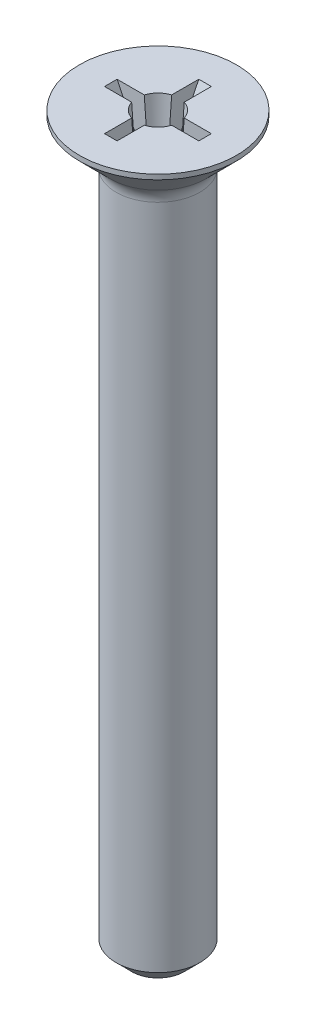
ISO-10303-21;
HEADER;
FILE_DESCRIPTION(('STEP AP214'),'2;1');
FILE_NAME('part.step','',(''),(''),'','','');
FILE_SCHEMA(('AUTOMOTIVE_DESIGN { 1 0 10303 214 1 1 1 1 }'));
ENDSEC;
DATA;
#1=APPLICATION_CONTEXT('core data for automotive mechanical design processes');
#2=APPLICATION_PROTOCOL_DEFINITION('international standard','automotive_design',2000,#1);
#3=PRODUCT_CONTEXT('',#1,'mechanical');
#4=PRODUCT('Part','Part','',(#3));
#5=PRODUCT_RELATED_PRODUCT_CATEGORY('part','',(#4));
#6=PRODUCT_DEFINITION_FORMATION('','',#4);
#7=PRODUCT_DEFINITION_CONTEXT('part definition',#1,'design');
#8=PRODUCT_DEFINITION('design','',#6,#7);
#9=PRODUCT_DEFINITION_SHAPE('','',#8);
#10=(LENGTH_UNIT() NAMED_UNIT(*) SI_UNIT(.MILLI.,.METRE.));
#11=(NAMED_UNIT(*) PLANE_ANGLE_UNIT() SI_UNIT($,.RADIAN.));
#12=(NAMED_UNIT(*) SI_UNIT($,.STERADIAN.) SOLID_ANGLE_UNIT());
#13=UNCERTAINTY_MEASURE_WITH_UNIT(LENGTH_MEASURE(1.E-05),#10,'distance_accuracy_value','');
#14=(GEOMETRIC_REPRESENTATION_CONTEXT(3) GLOBAL_UNCERTAINTY_ASSIGNED_CONTEXT((#13)) GLOBAL_UNIT_ASSIGNED_CONTEXT((#10,
#11,#12)) REPRESENTATION_CONTEXT('',''));
#15=CARTESIAN_POINT('',(0.,0.,0.));
#16=DIRECTION('',(0.,0.,1.));
#17=DIRECTION('',(1.,0.,0.));
#18=AXIS2_PLACEMENT_3D('',#15,#16,#17);
#19=CARTESIAN_POINT('',(0.,12.86,0.));
#20=DIRECTION('',(0.,1.,0.));
#21=DIRECTION('',(-1.,0.,0.));
#22=AXIS2_PLACEMENT_3D('',#19,#20,#21);
#23=CONICAL_SURFACE('',#22,0.320283434384406,0.0698131700797683);
#24=CARTESIAN_POINT('',(0.,14.,0.));
#25=DIRECTION('',(0.,1.,0.));
#26=DIRECTION('',(-1.,0.,0.));
#27=AXIS2_PLACEMENT_3D('',#24,#25,#26);
#28=CIRCLE('',#27,0.400000000000002);
#29=CARTESIAN_POINT('',(-0.381575680566779,14.,0.119999999999995));
#30=VERTEX_POINT('',#29);
#31=CARTESIAN_POINT('',(-0.12,14.,0.381575680566779));
#32=VERTEX_POINT('',#31);
#33=EDGE_CURVE('E260',#30,#32,#28,.T.);
#34=ORIENTED_EDGE('',*,*,#33,.T.);
#35=CARTESIAN_POINT('',(-0.12,15.1740824472663,0.466926394772055));
#36=CARTESIAN_POINT('',(-0.12,15.0242513219861,0.456108263948868));
#37=CARTESIAN_POINT('',(-0.12,14.8744218008497,0.445267913580182));
#38=CARTESIAN_POINT('',(-0.12,14.5747671449711,0.423529349100844));
#39=CARTESIAN_POINT('',(-0.12,14.4249420102236,0.41263113506235));
#40=CARTESIAN_POINT('',(-0.12,14.0593095650914,0.385947711733453));
#41=CARTESIAN_POINT('',(-0.12,13.8435050444475,0.370124175521628));
#42=CARTESIAN_POINT('',(-0.12,13.4119123652692,0.338257670637969));
#43=CARTESIAN_POINT('',(-0.12,13.1961242067238,0.322214702114726));
#44=CARTESIAN_POINT('',(-0.12,12.7645708959023,0.28980818309494));
#45=CARTESIAN_POINT('',(-0.12,12.5488057437202,0.273444631335357));
#46=CARTESIAN_POINT('',(-0.12,12.1173213669273,0.240116350239761));
#47=CARTESIAN_POINT('',(-0.12,11.9016021424536,0.223151619133535));
#48=CARTESIAN_POINT('',(-0.12,11.6859175527337,0.205746016838204));
#49=B_SPLINE_CURVE_WITH_KNOTS('',3,(#35,#36,#37,#38,#39,#40,#41,#42,#43,#44,#45,#46,#47,#48),
.UNSPECIFIED.,.F.,.F.,(4,2,2,2,2,2,4),(0.,0.450663487412317,0.901326412971773,1.55047789567899,
2.19962893883047,2.84878254003412,3.4979380528724),.UNSPECIFIED.);
#50=CARTESIAN_POINT('',(-0.12,12.86,0.296953663626282));
#51=VERTEX_POINT('',#50);
#52=EDGE_CURVE('E63',#32,#51,#49,.T.);
#53=ORIENTED_EDGE('',*,*,#52,.T.);
#54=CARTESIAN_POINT('',(0.,12.86,0.));
#55=DIRECTION('',(0.,1.,0.));
#56=DIRECTION('',(-1.,0.,0.));
#57=AXIS2_PLACEMENT_3D('',#54,#55,#56);
#58=CIRCLE('',#57,0.320283434384406);
#59=CARTESIAN_POINT('',(-0.29695366362628,12.86,0.119999999999995));
#60=VERTEX_POINT('',#59);
#61=EDGE_CURVE('E254',#60,#51,#58,.T.);
#62=ORIENTED_EDGE('',*,*,#61,.F.);
#63=CARTESIAN_POINT('',(-0.187820933769123,11.4671047713157,0.119999999999995));
#64=CARTESIAN_POINT('',(-0.193563556305856,11.5363168863722,0.119999999999995));
#65=CARTESIAN_POINT('',(-0.199232304699694,11.6055350727105,0.119999999999995));
#66=CARTESIAN_POINT('',(-0.210451948347549,11.7439808347204,0.119999999999995));
#67=CARTESIAN_POINT('',(-0.216002843889121,11.8132084103687,0.119999999999995));
#68=CARTESIAN_POINT('',(-0.243537554748596,12.1593644626035,0.119999999999995));
#69=CARTESIAN_POINT('',(-0.26486188936761,12.4363452438551,0.119999999999995));
#70=CARTESIAN_POINT('',(-0.30686468066746,12.9903567448575,0.119999999999995));
#71=CARTESIAN_POINT('',(-0.327543133428215,13.2673874649011,0.119999999999995));
#72=CARTESIAN_POINT('',(-0.370824552171335,13.8524858314913,0.119999999999995));
#73=CARTESIAN_POINT('',(-0.393383862392655,14.1605567086201,0.119999999999995));
#74=CARTESIAN_POINT('',(-0.438217174694349,14.776715510338,0.119999999999995));
#75=CARTESIAN_POINT('',(-0.460491180215733,15.0848034346764,0.119999999999995));
#76=CARTESIAN_POINT('',(-0.482708482373811,15.3928952286843,0.119999999999995));
#77=B_SPLINE_CURVE_WITH_KNOTS('',3,(#63,#64,#65,#66,#67,#68,#69,#70,#71,#72,#73,#74,#75,#76),
.UNSPECIFIED.,.F.,.F.,(4,2,2,2,2,2,4),(0.,0.208349707159258,0.416698905896739,1.25009792546417,
2.08350200223777,3.01018904395484,3.93686489851926),.UNSPECIFIED.);
#78=EDGE_CURVE('E301',#60,#30,#77,.T.);
#79=ORIENTED_EDGE('',*,*,#78,.T.);
#80=EDGE_LOOP('',(#34,#53,#62,#79));
#81=FACE_BOUND('',#80,.T.);
#82=ADVANCED_FACE('F42',(#81),#23,.F.);
#83=CARTESIAN_POINT('',(-0.12,12.86,-0.296953663626282));
#84=VERTEX_POINT('',#83);
#85=CARTESIAN_POINT('',(-0.29695366362628,12.86,-0.119999999999995));
#86=VERTEX_POINT('',#85);
#87=EDGE_CURVE('E264',#84,#86,#58,.T.);
#88=ORIENTED_EDGE('',*,*,#87,.F.);
#89=CARTESIAN_POINT('',(-0.12,11.6859175527337,-0.205746016838204));
#90=CARTESIAN_POINT('',(-0.12,11.7598931791331,-0.211733974991752));
#91=CARTESIAN_POINT('',(-0.12,11.8338739796323,-0.217657512604216));
#92=CARTESIAN_POINT('',(-0.12,11.9818436884213,-0.229401021808973));
#93=CARTESIAN_POINT('',(-0.12,12.055832596698,-0.235220993564825));
#94=CARTESIAN_POINT('',(-0.12,12.4257930473003,-0.264125223130743));
#95=CARTESIAN_POINT('',(-0.12,12.7218103478899,-0.286622436641393));
#96=CARTESIAN_POINT('',(-0.12,13.313889454487,-0.331030713125619));
#97=CARTESIAN_POINT('',(-0.12,13.609951260652,-0.352941773974435));
#98=CARTESIAN_POINT('',(-0.12,14.1173585648962,-0.39019870926174));
#99=CARTESIAN_POINT('',(-0.12,14.3286978823909,-0.405628694205982));
#100=CARTESIAN_POINT('',(-0.12,14.7513846677972,-0.436361242699685));
#101=CARTESIAN_POINT('',(-0.12,14.9627321356601,-0.451663806919752));
#102=CARTESIAN_POINT('',(-0.12,15.1740824472663,-0.466926394772055));
#103=B_SPLINE_CURVE_WITH_KNOTS('',3,(#89,#90,#91,#92,#93,#94,#95,#96,#97,#98,#99,#100,#101,
#102),.UNSPECIFIED.,.F.,.F.,(4,2,2,2,2,2,4),(0.,0.222652649737815,0.445304947812353,
1.33591611572056,2.22653051159222,2.86223598658223,3.49793811378913),.UNSPECIFIED.);
#104=CARTESIAN_POINT('',(-0.12,14.,-0.381575680566779));
#105=VERTEX_POINT('',#104);
#106=EDGE_CURVE('E56',#84,#105,#103,.T.);
#107=ORIENTED_EDGE('',*,*,#106,.T.);
#108=CARTESIAN_POINT('',(-0.381575680566779,14.,-0.119999999999995));
#109=VERTEX_POINT('',#108);
#110=EDGE_CURVE('E271',#105,#109,#28,.T.);
#111=ORIENTED_EDGE('',*,*,#110,.T.);
#112=CARTESIAN_POINT('',(-0.187820933769123,11.4671047713157,-0.119999999999995));
#113=CARTESIAN_POINT('',(-0.193563556305856,11.5363168863722,-0.119999999999995));
#114=CARTESIAN_POINT('',(-0.199232304699694,11.6055350727105,-0.119999999999995));
#115=CARTESIAN_POINT('',(-0.210451948347549,11.7439808347204,-0.119999999999995));
#116=CARTESIAN_POINT('',(-0.216002843889121,11.8132084103687,-0.119999999999995));
#117=CARTESIAN_POINT('',(-0.243537554748596,12.1593644626035,-0.119999999999995));
#118=CARTESIAN_POINT('',(-0.26486188936761,12.4363452438551,-0.119999999999995));
#119=CARTESIAN_POINT('',(-0.30686468066746,12.9903567448575,-0.119999999999995));
#120=CARTESIAN_POINT('',(-0.327543133428215,13.2673874649011,-0.119999999999995));
#121=CARTESIAN_POINT('',(-0.370824552171335,13.8524858314913,-0.119999999999995));
#122=CARTESIAN_POINT('',(-0.393383862392656,14.1605567086201,-0.119999999999995));
#123=CARTESIAN_POINT('',(-0.438217174694352,14.776715510338,-0.119999999999995));
#124=CARTESIAN_POINT('',(-0.460491180215736,15.0848034346765,-0.119999999999995));
#125=CARTESIAN_POINT('',(-0.482708482373815,15.3928952286844,-0.119999999999995));
#126=B_SPLINE_CURVE_WITH_KNOTS('',3,(#112,#113,#114,#115,#116,#117,#118,#119,#120,#121,#122,
#123,#124,#125),.UNSPECIFIED.,.F.,.F.,(4,2,2,2,2,2,4),(0.,0.208349707159258,0.416698905896739,
1.25009792546417,2.08350200223777,3.01018904395486,3.93686489851931),.UNSPECIFIED.);
#127=EDGE_CURVE('E394',#86,#109,#126,.T.);
#128=ORIENTED_EDGE('',*,*,#127,.F.);
#129=EDGE_LOOP('',(#88,#107,#111,#128));
#130=FACE_BOUND('',#129,.T.);
#131=ADVANCED_FACE('F357',(#130),#23,.F.);
#132=CARTESIAN_POINT('',(0.12,15.1740824472663,0.466926394772055));
#133=CARTESIAN_POINT('',(0.12,15.0242513219861,0.456108263948871));
#134=CARTESIAN_POINT('',(0.12,14.8744218008497,0.445267913580184));
#135=CARTESIAN_POINT('',(0.12,14.5747671449711,0.423529349100846));
#136=CARTESIAN_POINT('',(0.12,14.4249420102236,0.41263113506235));
#137=CARTESIAN_POINT('',(0.12,14.0593095650914,0.385947711733453));
#138=CARTESIAN_POINT('',(0.12,13.8435050444475,0.370124175521629));
#139=CARTESIAN_POINT('',(0.12,13.4119123652692,0.338257670637971));
#140=CARTESIAN_POINT('',(0.12,13.1961242067238,0.322214702114727));
#141=CARTESIAN_POINT('',(0.12,12.7645708959023,0.28980818309494));
#142=CARTESIAN_POINT('',(0.12,12.5488057437202,0.273444631335356));
#143=CARTESIAN_POINT('',(0.12,12.1173213669273,0.24011635023976));
#144=CARTESIAN_POINT('',(0.12,11.9016021424536,0.223151619133534));
#145=CARTESIAN_POINT('',(0.12,11.6859175527337,0.205746016838204));
#146=B_SPLINE_CURVE_WITH_KNOTS('',3,(#132,#133,#134,#135,#136,#137,#138,#139,#140,#141,#142,
#143,#144,#145),.UNSPECIFIED.,.F.,.F.,(4,2,2,2,2,2,4),(0.,0.450663487412317,0.901326412971773,
1.55047789567899,2.19962893883047,2.84878254003412,3.4979380528724),.UNSPECIFIED.);
#147=CARTESIAN_POINT('',(0.12,14.,0.381575680566779));
#148=VERTEX_POINT('',#147);
#149=CARTESIAN_POINT('',(0.12,12.86,0.296953663626282));
#150=VERTEX_POINT('',#149);
#151=EDGE_CURVE('E224',#148,#150,#146,.T.);
#152=ORIENTED_EDGE('',*,*,#151,.F.);
#153=CARTESIAN_POINT('',(0.381575680566782,14.,0.119999999999995));
#154=VERTEX_POINT('',#153);
#155=EDGE_CURVE('E265',#148,#154,#28,.T.);
#156=ORIENTED_EDGE('',*,*,#155,.T.);
#157=CARTESIAN_POINT('',(0.482708482373816,15.3928952286843,0.119999999999995));
#158=CARTESIAN_POINT('',(0.471569124413629,15.2383071523705,0.119999999999995));
#159=CARTESIAN_POINT('',(0.460408440154064,15.0837206120034,0.119999999999995));
#160=CARTESIAN_POINT('',(0.438031378451938,14.7745517948923,0.119999999999995));
#161=CARTESIAN_POINT('',(0.426815001092503,14.6199695181423,0.119999999999995));
#162=CARTESIAN_POINT('',(0.397374651708443,14.2154739650048,0.119999999999995));
#163=CARTESIAN_POINT('',(0.37909518965734,13.9655647184375,0.119999999999995));
#164=CARTESIAN_POINT('',(0.342262541830037,13.4657666524732,0.119999999999995));
#165=CARTESIAN_POINT('',(0.323709356352955,13.2158778330542,0.119999999999995));
#166=CARTESIAN_POINT('',(0.286158435803668,12.7161319689566,0.119999999999995));
#167=CARTESIAN_POINT('',(0.267160698237998,12.4662749244641,0.119999999999995));
#168=CARTESIAN_POINT('',(0.238044995888112,12.0915366773594,0.119999999999995));
#169=CARTESIAN_POINT('',(0.228236556284122,11.9666315332682,0.119999999999995));
#170=CARTESIAN_POINT('',(0.208298411255087,11.716846612886,0.119999999999995));
#171=CARTESIAN_POINT('',(0.198168704997794,11.5919668366615,0.119999999999995));
#172=CARTESIAN_POINT('',(0.187820933769118,11.4671047713157,0.119999999999995));
#173=B_SPLINE_CURVE_WITH_KNOTS('',3,(#157,#158,#159,#160,#161,#162,#163,#164,#165,#166,#167,
#168,#169,#170,#171,#172),.UNSPECIFIED.,.F.,.F.,(4,2,2,2,2,2,2,4),(0.,0.464966692939739,
0.92993269209604,1.6816632061309,2.43339289875489,3.18512680879476,3.56099545931275,
3.93686508360733),.UNSPECIFIED.);
#174=CARTESIAN_POINT('',(0.29695366362628,12.86,0.119999999999995));
#175=VERTEX_POINT('',#174);
#176=EDGE_CURVE('E292',#154,#175,#173,.T.);
#177=ORIENTED_EDGE('',*,*,#176,.T.);
#178=EDGE_CURVE('E258',#150,#175,#58,.T.);
#179=ORIENTED_EDGE('',*,*,#178,.F.);
#180=EDGE_LOOP('',(#152,#156,#177,#179));
#181=FACE_BOUND('',#180,.T.);
#182=ADVANCED_FACE('F351',(#181),#23,.F.);
#183=CARTESIAN_POINT('',(-0.400000000000001,14.,0.));
#184=DIRECTION('',(0.,1.,0.));
#185=DIRECTION('',(-1.,0.,0.));
#186=AXIS2_PLACEMENT_3D('',#183,#184,#185);
#187=PLANE('',#186);
#188=DIRECTION('',(0.,0.,1.));
#189=VECTOR('',#188,1.);
#190=CARTESIAN_POINT('',(0.12,14.,0.899999999999998));
#191=LINE('',#190,#189);
#192=CARTESIAN_POINT('',(0.12,14.,0.899999999999998));
#193=VERTEX_POINT('',#192);
#194=EDGE_CURVE('E200',#148,#193,#191,.T.);
#195=ORIENTED_EDGE('',*,*,#194,.T.);
#196=DIRECTION('',(-1.,0.,0.));
#197=VECTOR('',#196,1.);
#198=CARTESIAN_POINT('',(0.12,14.,0.899999999999998));
#199=LINE('',#198,#197);
#200=CARTESIAN_POINT('',(-0.12,14.,0.899999999999998));
#201=VERTEX_POINT('',#200);
#202=EDGE_CURVE('E211',#193,#201,#199,.T.);
#203=ORIENTED_EDGE('',*,*,#202,.T.);
#204=DIRECTION('',(0.,0.,1.));
#205=VECTOR('',#204,1.);
#206=CARTESIAN_POINT('',(-0.12,14.,0.899999999999998));
#207=LINE('',#206,#205);
#208=EDGE_CURVE('E181',#32,#201,#207,.T.);
#209=ORIENTED_EDGE('',*,*,#208,.F.);
#210=ORIENTED_EDGE('',*,*,#33,.F.);
#211=DIRECTION('',(-1.,0.,0.));
#212=VECTOR('',#211,1.);
#213=CARTESIAN_POINT('',(-0.400000000000001,14.,0.119999999999995));
#214=LINE('',#213,#212);
#215=CARTESIAN_POINT('',(-0.900000000000001,14.,0.119999999999995));
#216=VERTEX_POINT('',#215);
#217=EDGE_CURVE('E247',#30,#216,#214,.T.);
#218=ORIENTED_EDGE('',*,*,#217,.T.);
#219=DIRECTION('',(0.,0.,-1.));
#220=VECTOR('',#219,1.);
#221=CARTESIAN_POINT('',(-0.900000000000001,14.,0.119999999999995));
#222=LINE('',#221,#220);
#223=CARTESIAN_POINT('',(-0.900000000000001,14.,-0.119999999999995));
#224=VERTEX_POINT('',#223);
#225=EDGE_CURVE('E404',#216,#224,#222,.T.);
#226=ORIENTED_EDGE('',*,*,#225,.T.);
#227=DIRECTION('',(-1.,0.,0.));
#228=VECTOR('',#227,1.);
#229=CARTESIAN_POINT('',(-0.400000000000001,14.,-0.119999999999995));
#230=LINE('',#229,#228);
#231=EDGE_CURVE('E251',#109,#224,#230,.T.);
#232=ORIENTED_EDGE('',*,*,#231,.F.);
#233=ORIENTED_EDGE('',*,*,#110,.F.);
#234=CARTESIAN_POINT('',(-0.12,14.,-0.899999999999998));
#235=VERTEX_POINT('',#234);
#236=EDGE_CURVE('E71',#235,#105,#207,.T.);
#237=ORIENTED_EDGE('',*,*,#236,.F.);
#238=DIRECTION('',(-1.,0.,0.));
#239=VECTOR('',#238,1.);
#240=CARTESIAN_POINT('',(0.12,14.,-0.899999999999998));
#241=LINE('',#240,#239);
#242=CARTESIAN_POINT('',(0.12,14.,-0.899999999999998));
#243=VERTEX_POINT('',#242);
#244=EDGE_CURVE('E176',#243,#235,#241,.T.);
#245=ORIENTED_EDGE('',*,*,#244,.F.);
#246=CARTESIAN_POINT('',(0.12,14.,-0.381575680566779));
#247=VERTEX_POINT('',#246);
#248=EDGE_CURVE('E201',#243,#247,#191,.T.);
#249=ORIENTED_EDGE('',*,*,#248,.T.);
#250=CARTESIAN_POINT('',(0.381575680566782,14.,-0.119999999999995));
#251=VERTEX_POINT('',#250);
#252=EDGE_CURVE('E266',#251,#247,#28,.T.);
#253=ORIENTED_EDGE('',*,*,#252,.F.);
#254=DIRECTION('',(-1.,0.,0.));
#255=VECTOR('',#254,1.);
#256=CARTESIAN_POINT('',(-0.900000000000001,14.,-0.119999999999995));
#257=LINE('',#256,#255);
#258=CARTESIAN_POINT('',(0.899999999999998,14.,-0.119999999999995));
#259=VERTEX_POINT('',#258);
#260=EDGE_CURVE('E448',#259,#251,#257,.T.);
#261=ORIENTED_EDGE('',*,*,#260,.F.);
#262=DIRECTION('',(0.,0.,-1.));
#263=VECTOR('',#262,1.);
#264=CARTESIAN_POINT('',(0.899999999999998,14.,0.119999999999995));
#265=LINE('',#264,#263);
#266=CARTESIAN_POINT('',(0.899999999999998,14.,0.119999999999995));
#267=VERTEX_POINT('',#266);
#268=EDGE_CURVE('E426',#267,#259,#265,.T.);
#269=ORIENTED_EDGE('',*,*,#268,.F.);
#270=DIRECTION('',(-1.,0.,0.));
#271=VECTOR('',#270,1.);
#272=CARTESIAN_POINT('',(-0.900000000000001,14.,0.119999999999995));
#273=LINE('',#272,#271);
#274=EDGE_CURVE('E441',#267,#154,#273,.T.);
#275=ORIENTED_EDGE('',*,*,#274,.T.);
#276=ORIENTED_EDGE('',*,*,#155,.F.);
#277=EDGE_LOOP('',(#195,#203,#209,#210,#218,#226,#232,#233,#237,#245,#249,#253,#261,#269,#275,#276));
#278=FACE_BOUND('',#277,.T.);
#279=CARTESIAN_POINT('',(0.,14.,0.));
#280=DIRECTION('',(0.,1.,0.));
#281=DIRECTION('',(-1.,0.,0.));
#282=AXIS2_PLACEMENT_3D('',#279,#280,#281);
#283=CIRCLE('',#282,1.5);
#284=CARTESIAN_POINT('',(-1.5,14.,0.));
#285=VERTEX_POINT('',#284);
#286=EDGE_CURVE('E267',#285,#285,#283,.T.);
#287=ORIENTED_EDGE('',*,*,#286,.T.);
#288=EDGE_LOOP('',(#287));
#289=FACE_BOUND('',#288,.T.);
#290=ADVANCED_FACE('F349',(#278,#289),#187,.T.);
#291=CARTESIAN_POINT('',(-0.320283434384406,12.86,0.));
#292=DIRECTION('',(0.,1.,0.));
#293=DIRECTION('',(-1.,0.,0.));
#294=AXIS2_PLACEMENT_3D('',#291,#292,#293);
#295=PLANE('',#294);
#296=CARTESIAN_POINT('',(0.29695366362628,12.86,-0.119999999999995));
#297=VERTEX_POINT('',#296);
#298=CARTESIAN_POINT('',(0.12,12.86,-0.296953663626282));
#299=VERTEX_POINT('',#298);
#300=EDGE_CURVE('E259',#297,#299,#58,.T.);
#301=ORIENTED_EDGE('',*,*,#300,.T.);
#302=DIRECTION('',(0.,0.,-1.));
#303=VECTOR('',#302,1.);
#304=CARTESIAN_POINT('',(0.12,12.86,0.343984849034917));
#305=LINE('',#304,#303);
#306=CARTESIAN_POINT('',(0.12,12.86,-0.343984849034917));
#307=VERTEX_POINT('',#306);
#308=EDGE_CURVE('E172',#299,#307,#305,.T.);
#309=ORIENTED_EDGE('',*,*,#308,.T.);
#310=DIRECTION('',(-1.,0.,0.));
#311=VECTOR('',#310,1.);
#312=CARTESIAN_POINT('',(0.12,12.86,-0.343984849034917));
#313=LINE('',#312,#311);
#314=CARTESIAN_POINT('',(-0.12,12.86,-0.343984849034917));
#315=VERTEX_POINT('',#314);
#316=EDGE_CURVE('E170',#307,#315,#313,.T.);
#317=ORIENTED_EDGE('',*,*,#316,.T.);
#318=DIRECTION('',(0.,0.,-1.));
#319=VECTOR('',#318,1.);
#320=CARTESIAN_POINT('',(-0.12,12.86,0.343984849034917));
#321=LINE('',#320,#319);
#322=EDGE_CURVE('E159',#84,#315,#321,.T.);
#323=ORIENTED_EDGE('',*,*,#322,.F.);
#324=ORIENTED_EDGE('',*,*,#87,.T.);
#325=DIRECTION('',(1.,0.,0.));
#326=VECTOR('',#325,1.);
#327=CARTESIAN_POINT('',(-0.343984849034917,12.86,-0.119999999999995));
#328=LINE('',#327,#326);
#329=CARTESIAN_POINT('',(-0.343984849034917,12.86,-0.119999999999995));
#330=VERTEX_POINT('',#329);
#331=EDGE_CURVE('E389',#330,#86,#328,.T.);
#332=ORIENTED_EDGE('',*,*,#331,.F.);
#333=DIRECTION('',(0.,0.,-1.));
#334=VECTOR('',#333,1.);
#335=CARTESIAN_POINT('',(-0.343984849034917,12.86,0.119999999999995));
#336=LINE('',#335,#334);
#337=CARTESIAN_POINT('',(-0.343984849034917,12.86,0.119999999999995));
#338=VERTEX_POINT('',#337);
#339=EDGE_CURVE('E410',#338,#330,#336,.T.);
#340=ORIENTED_EDGE('',*,*,#339,.F.);
#341=DIRECTION('',(1.,0.,0.));
#342=VECTOR('',#341,1.);
#343=CARTESIAN_POINT('',(-0.343984849034917,12.86,0.119999999999995));
#344=LINE('',#343,#342);
#345=EDGE_CURVE('E433',#338,#60,#344,.T.);
#346=ORIENTED_EDGE('',*,*,#345,.T.);
#347=ORIENTED_EDGE('',*,*,#61,.T.);
#348=CARTESIAN_POINT('',(-0.12,12.86,0.343984849034917));
#349=VERTEX_POINT('',#348);
#350=EDGE_CURVE('E167',#349,#51,#321,.T.);
#351=ORIENTED_EDGE('',*,*,#350,.F.);
#352=DIRECTION('',(-1.,0.,0.));
#353=VECTOR('',#352,1.);
#354=CARTESIAN_POINT('',(0.12,12.86,0.343984849034917));
#355=LINE('',#354,#353);
#356=CARTESIAN_POINT('',(0.12,12.86,0.343984849034917));
#357=VERTEX_POINT('',#356);
#358=EDGE_CURVE('E208',#357,#349,#355,.T.);
#359=ORIENTED_EDGE('',*,*,#358,.F.);
#360=EDGE_CURVE('E193',#357,#150,#305,.T.);
#361=ORIENTED_EDGE('',*,*,#360,.T.);
#362=ORIENTED_EDGE('',*,*,#178,.T.);
#363=CARTESIAN_POINT('',(0.343984849034914,12.86,0.119999999999995));
#364=VERTEX_POINT('',#363);
#365=EDGE_CURVE('E437',#175,#364,#344,.T.);
#366=ORIENTED_EDGE('',*,*,#365,.T.);
#367=DIRECTION('',(0.,0.,-1.));
#368=VECTOR('',#367,1.);
#369=CARTESIAN_POINT('',(0.343984849034914,12.86,0.119999999999995));
#370=LINE('',#369,#368);
#371=CARTESIAN_POINT('',(0.343984849034914,12.86,-0.119999999999995));
#372=VERTEX_POINT('',#371);
#373=EDGE_CURVE('E423',#364,#372,#370,.T.);
#374=ORIENTED_EDGE('',*,*,#373,.T.);
#375=EDGE_CURVE('E380',#297,#372,#328,.T.);
#376=ORIENTED_EDGE('',*,*,#375,.F.);
#377=EDGE_LOOP('',(#301,#309,#317,#323,#324,#332,#340,#346,#347,#351,#359,#361,#362,#366,#374,#376));
#378=FACE_BOUND('',#377,.T.);
#379=ADVANCED_FACE('F44',(#378),#295,.T.);
#380=CARTESIAN_POINT('',(0.12,11.6859175527337,-0.205746016838204));
#381=CARTESIAN_POINT('',(0.12,11.7598931791331,-0.211733974991751));
#382=CARTESIAN_POINT('',(0.12,11.8338739796323,-0.217657512604214));
#383=CARTESIAN_POINT('',(0.12,11.9818436884213,-0.229401021808971));
#384=CARTESIAN_POINT('',(0.12,12.055832596698,-0.235220993564824));
#385=CARTESIAN_POINT('',(0.12,12.4257930473003,-0.264125223130746));
#386=CARTESIAN_POINT('',(0.12,12.7218103478899,-0.286622436641394));
#387=CARTESIAN_POINT('',(0.12,13.313889454487,-0.331030713125619));
#388=CARTESIAN_POINT('',(0.12,13.609951260652,-0.352941773974435));
#389=CARTESIAN_POINT('',(0.12,14.1173585648962,-0.390198709261741));
#390=CARTESIAN_POINT('',(0.12,14.3286978823909,-0.405628694205983));
#391=CARTESIAN_POINT('',(0.12,14.7513846677972,-0.436361242699687));
#392=CARTESIAN_POINT('',(0.12,14.9627321356601,-0.451663806919754));
#393=CARTESIAN_POINT('',(0.12,15.1740824472663,-0.466926394772055));
#394=B_SPLINE_CURVE_WITH_KNOTS('',3,(#380,#381,#382,#383,#384,#385,#386,#387,#388,#389,#390,
#391,#392,#393),.UNSPECIFIED.,.F.,.F.,(4,2,2,2,2,2,4),(0.,0.222652649737815,0.445304947812353,
1.33591611572056,2.22653051159222,2.86223598658222,3.49793811378913),.UNSPECIFIED.);
#395=EDGE_CURVE('E11',#299,#247,#394,.T.);
#396=ORIENTED_EDGE('',*,*,#395,.F.);
#397=ORIENTED_EDGE('',*,*,#300,.F.);
#398=CARTESIAN_POINT('',(0.482708482373816,15.3928952286843,-0.119999999999995));
#399=CARTESIAN_POINT('',(0.471569124413629,15.2383071523705,-0.119999999999995));
#400=CARTESIAN_POINT('',(0.460408440154064,15.0837206120034,-0.119999999999995));
#401=CARTESIAN_POINT('',(0.438031378451938,14.7745517948923,-0.119999999999995));
#402=CARTESIAN_POINT('',(0.426815001092503,14.6199695181423,-0.119999999999995));
#403=CARTESIAN_POINT('',(0.397374651708443,14.2154739650048,-0.119999999999995));
#404=CARTESIAN_POINT('',(0.37909518965734,13.9655647184375,-0.119999999999995));
#405=CARTESIAN_POINT('',(0.342262541830037,13.4657666524732,-0.119999999999995));
#406=CARTESIAN_POINT('',(0.323709356352955,13.2158778330542,-0.119999999999995));
#407=CARTESIAN_POINT('',(0.286158435803668,12.7161319689566,-0.119999999999995));
#408=CARTESIAN_POINT('',(0.267160698237998,12.4662749244641,-0.119999999999995));
#409=CARTESIAN_POINT('',(0.238044995888112,12.0915366773594,-0.119999999999995));
#410=CARTESIAN_POINT('',(0.228236556284122,11.9666315332682,-0.119999999999995));
#411=CARTESIAN_POINT('',(0.208298411255087,11.716846612886,-0.119999999999995));
#412=CARTESIAN_POINT('',(0.198168704997794,11.5919668366615,-0.119999999999995));
#413=CARTESIAN_POINT('',(0.187820933769118,11.4671047713157,-0.119999999999995));
#414=B_SPLINE_CURVE_WITH_KNOTS('',3,(#398,#399,#400,#401,#402,#403,#404,#405,#406,#407,#408,
#409,#410,#411,#412,#413),.UNSPECIFIED.,.F.,.F.,(4,2,2,2,2,2,2,4),(0.,0.464966692939739,
0.92993269209604,1.6816632061309,2.43339289875489,3.18512680879476,3.56099545931275,
3.93686508360733),.UNSPECIFIED.);
#415=EDGE_CURVE('E403',#251,#297,#414,.T.);
#416=ORIENTED_EDGE('',*,*,#415,.F.);
#417=ORIENTED_EDGE('',*,*,#252,.T.);
#418=EDGE_LOOP('',(#396,#397,#416,#417));
#419=FACE_BOUND('',#418,.T.);
#420=ADVANCED_FACE('F230',(#419),#23,.F.);
#421=CARTESIAN_POINT('',(0.,12.86,0.));
#422=DIRECTION('',(0.,1.,0.));
#423=DIRECTION('',(-1.,0.,0.));
#424=AXIS2_PLACEMENT_3D('',#421,#422,#423);
#425=CYLINDRICAL_SURFACE('',#424,1.5);
#426=CARTESIAN_POINT('',(0.,13.9056854249492,0.));
#427=DIRECTION('',(0.,1.,0.));
#428=DIRECTION('',(-1.,0.,0.));
#429=AXIS2_PLACEMENT_3D('',#426,#427,#428);
#430=CIRCLE('',#429,1.5);
#431=CARTESIAN_POINT('',(-1.5,13.9056854249492,0.));
#432=VERTEX_POINT('',#431);
#433=EDGE_CURVE('E272',#432,#432,#430,.T.);
#434=ORIENTED_EDGE('',*,*,#433,.T.);
#435=EDGE_LOOP('',(#434));
#436=FACE_BOUND('',#435,.T.);
#437=ORIENTED_EDGE('',*,*,#286,.F.);
#438=EDGE_LOOP('',(#437));
#439=FACE_BOUND('',#438,.T.);
#440=ADVANCED_FACE('F345',(#436,#439),#425,.T.);
#441=CARTESIAN_POINT('',(0.,13.9056854249492,0.));
#442=DIRECTION('',(0.,1.,0.));
#443=DIRECTION('',(-1.,0.,0.));
#444=AXIS2_PLACEMENT_3D('',#441,#442,#443);
#445=CONICAL_SURFACE('',#444,1.5,0.785398163397446);
#446=CARTESIAN_POINT('',(0.,13.3228427124746,0.));
#447=DIRECTION('',(0.,1.,0.));
#448=DIRECTION('',(-1.,0.,0.));
#449=AXIS2_PLACEMENT_3D('',#446,#447,#448);
#450=CIRCLE('',#449,0.91715728752538);
#451=CARTESIAN_POINT('',(-0.91715728752538,13.3228427124746,0.));
#452=VERTEX_POINT('',#451);
#453=EDGE_CURVE('E276',#452,#452,#450,.T.);
#454=ORIENTED_EDGE('',*,*,#453,.T.);
#455=EDGE_LOOP('',(#454));
#456=FACE_BOUND('',#455,.T.);
#457=ORIENTED_EDGE('',*,*,#433,.F.);
#458=EDGE_LOOP('',(#457));
#459=FACE_BOUND('',#458,.T.);
#460=ADVANCED_FACE('F341',(#456,#459),#445,.T.);
#461=CARTESIAN_POINT('',(0.,13.04,0.));
#462=DIRECTION('',(0.,1.,0.));
#463=DIRECTION('',(-1.,0.,0.));
#464=AXIS2_PLACEMENT_3D('',#461,#462,#463);
#465=TOROIDAL_SURFACE('',#464,1.2,0.4);
#466=CARTESIAN_POINT('',(0.,13.04,0.));
#467=DIRECTION('',(0.,1.,0.));
#468=DIRECTION('',(-1.,0.,0.));
#469=AXIS2_PLACEMENT_3D('',#466,#467,#468);
#470=CIRCLE('',#469,0.8);
#471=CARTESIAN_POINT('',(-0.8,13.04,0.));
#472=VERTEX_POINT('',#471);
#473=EDGE_CURVE('E280',#472,#472,#470,.T.);
#474=ORIENTED_EDGE('',*,*,#473,.T.);
#475=EDGE_LOOP('',(#474));
#476=FACE_BOUND('',#475,.T.);
#477=ORIENTED_EDGE('',*,*,#453,.F.);
#478=EDGE_LOOP('',(#477));
#479=FACE_BOUND('',#478,.T.);
#480=ADVANCED_FACE('F337',(#476,#479),#465,.F.);
#481=CARTESIAN_POINT('',(0.,12.86,0.));
#482=DIRECTION('',(0.,1.,0.));
#483=DIRECTION('',(-1.,0.,0.));
#484=AXIS2_PLACEMENT_3D('',#481,#482,#483);
#485=CYLINDRICAL_SURFACE('',#484,0.799999999999988);
#486=CARTESIAN_POINT('',(0.,0.299999999999998,0.));
#487=DIRECTION('',(0.,1.,0.));
#488=DIRECTION('',(-1.,0.,0.));
#489=AXIS2_PLACEMENT_3D('',#486,#487,#488);
#490=CIRCLE('',#489,0.799999999999977);
#491=CARTESIAN_POINT('',(-0.799999999999999,0.3,0.));
#492=VERTEX_POINT('',#491);
#493=EDGE_CURVE('E284',#492,#492,#490,.T.);
#494=ORIENTED_EDGE('',*,*,#493,.T.);
#495=EDGE_LOOP('',(#494));
#496=FACE_BOUND('',#495,.T.);
#497=ORIENTED_EDGE('',*,*,#473,.F.);
#498=EDGE_LOOP('',(#497));
#499=FACE_BOUND('',#498,.T.);
#500=ADVANCED_FACE('F333',(#496,#499),#485,.T.);
#501=CARTESIAN_POINT('',(0.,0.299999999999998,0.));
#502=DIRECTION('',(0.,1.,0.));
#503=DIRECTION('',(-1.,0.,0.));
#504=AXIS2_PLACEMENT_3D('',#501,#502,#503);
#505=CONICAL_SURFACE('',#504,0.799999999999977,0.785398163397444);
#506=CARTESIAN_POINT('',(0.,0.,0.));
#507=DIRECTION('',(0.,1.,0.));
#508=DIRECTION('',(-1.,0.,0.));
#509=AXIS2_PLACEMENT_3D('',#506,#507,#508);
#510=CIRCLE('',#509,0.499999999999979);
#511=CARTESIAN_POINT('',(-0.500000000000004,0.,0.));
#512=VERTEX_POINT('',#511);
#513=EDGE_CURVE('E288',#512,#512,#510,.T.);
#514=ORIENTED_EDGE('',*,*,#513,.T.);
#515=EDGE_LOOP('',(#514));
#516=FACE_BOUND('',#515,.T.);
#517=ORIENTED_EDGE('',*,*,#493,.F.);
#518=EDGE_LOOP('',(#517));
#519=FACE_BOUND('',#518,.T.);
#520=ADVANCED_FACE('F329',(#516,#519),#505,.T.);
#521=CARTESIAN_POINT('',(0.,0.,0.));
#522=DIRECTION('',(0.,-1.,0.));
#523=DIRECTION('',(1.,0.,0.));
#524=AXIS2_PLACEMENT_3D('',#521,#522,#523);
#525=PLANE('',#524);
#526=ORIENTED_EDGE('',*,*,#513,.F.);
#527=EDGE_LOOP('',(#526));
#528=FACE_BOUND('',#527,.T.);
#529=ADVANCED_FACE('F313',(#528),#525,.T.);
#530=CARTESIAN_POINT('',(0.,0.,0.119999999999995));
#531=DIRECTION('',(0.,0.,-1.));
#532=DIRECTION('',(-1.,0.,0.));
#533=AXIS2_PLACEMENT_3D('',#530,#531,#532);
#534=PLANE('',#533);
#535=ORIENTED_EDGE('',*,*,#345,.F.);
#536=DIRECTION('',(0.438371146789079,-0.898794046299166,0.));
#537=VECTOR('',#536,1.);
#538=CARTESIAN_POINT('',(-0.900000000000001,14.,0.119999999999995));
#539=LINE('',#538,#537);
#540=EDGE_CURVE('E438',#216,#338,#539,.T.);
#541=ORIENTED_EDGE('',*,*,#540,.F.);
#542=ORIENTED_EDGE('',*,*,#217,.F.);
#543=ORIENTED_EDGE('',*,*,#78,.F.);
#544=EDGE_LOOP('',(#535,#541,#542,#543));
#545=FACE_BOUND('',#544,.T.);
#546=ADVANCED_FACE('F307',(#545),#534,.T.);
#547=CARTESIAN_POINT('',(0.,0.,-0.119999999999995));
#548=DIRECTION('',(0.,0.,-1.));
#549=DIRECTION('',(-1.,0.,0.));
#550=AXIS2_PLACEMENT_3D('',#547,#548,#549);
#551=PLANE('',#550);
#552=ORIENTED_EDGE('',*,*,#127,.T.);
#553=ORIENTED_EDGE('',*,*,#231,.T.);
#554=DIRECTION('',(0.438371146789079,-0.898794046299166,0.));
#555=VECTOR('',#554,1.);
#556=CARTESIAN_POINT('',(-0.900000000000001,14.,-0.119999999999995));
#557=LINE('',#556,#555);
#558=EDGE_CURVE('E397',#224,#330,#557,.T.);
#559=ORIENTED_EDGE('',*,*,#558,.T.);
#560=ORIENTED_EDGE('',*,*,#331,.T.);
#561=EDGE_LOOP('',(#552,#553,#559,#560));
#562=FACE_BOUND('',#561,.T.);
#563=ADVANCED_FACE('F312',(#562),#551,.F.);
#564=CARTESIAN_POINT('',(-0.900000000000001,14.,0.119999999999995));
#565=DIRECTION('',(0.898794046299166,0.438371146789079,0.));
#566=DIRECTION('',(-0.438371146789079,0.898794046299166,0.));
#567=AXIS2_PLACEMENT_3D('',#564,#565,#566);
#568=PLANE('',#567);
#569=ORIENTED_EDGE('',*,*,#225,.F.);
#570=ORIENTED_EDGE('',*,*,#540,.T.);
#571=ORIENTED_EDGE('',*,*,#339,.T.);
#572=ORIENTED_EDGE('',*,*,#558,.F.);
#573=EDGE_LOOP('',(#569,#570,#571,#572));
#574=FACE_BOUND('',#573,.T.);
#575=ADVANCED_FACE('F323',(#574),#568,.T.);
#576=ORIENTED_EDGE('',*,*,#274,.F.);
#577=DIRECTION('',(0.438371146789079,0.898794046299167,0.));
#578=VECTOR('',#577,1.);
#579=CARTESIAN_POINT('',(0.899999999999998,14.,0.119999999999995));
#580=LINE('',#579,#578);
#581=EDGE_CURVE('E430',#364,#267,#580,.T.);
#582=ORIENTED_EDGE('',*,*,#581,.F.);
#583=ORIENTED_EDGE('',*,*,#365,.F.);
#584=ORIENTED_EDGE('',*,*,#176,.F.);
#585=EDGE_LOOP('',(#576,#582,#583,#584));
#586=FACE_BOUND('',#585,.T.);
#587=ADVANCED_FACE('F315',(#586),#534,.T.);
#588=ORIENTED_EDGE('',*,*,#415,.T.);
#589=ORIENTED_EDGE('',*,*,#375,.T.);
#590=DIRECTION('',(0.438371146789079,0.898794046299167,0.));
#591=VECTOR('',#590,1.);
#592=CARTESIAN_POINT('',(0.899999999999998,14.,-0.119999999999995));
#593=LINE('',#592,#591);
#594=EDGE_CURVE('E399',#372,#259,#593,.T.);
#595=ORIENTED_EDGE('',*,*,#594,.T.);
#596=ORIENTED_EDGE('',*,*,#260,.T.);
#597=EDGE_LOOP('',(#588,#589,#595,#596));
#598=FACE_BOUND('',#597,.T.);
#599=ADVANCED_FACE('F321',(#598),#551,.F.);
#600=CARTESIAN_POINT('',(0.899999999999998,14.,0.119999999999995));
#601=DIRECTION('',(-0.898794046299166,0.438371146789079,0.));
#602=DIRECTION('',(-0.438371146789079,-0.898794046299166,0.));
#603=AXIS2_PLACEMENT_3D('',#600,#601,#602);
#604=PLANE('',#603);
#605=ORIENTED_EDGE('',*,*,#373,.F.);
#606=ORIENTED_EDGE('',*,*,#581,.T.);
#607=ORIENTED_EDGE('',*,*,#268,.T.);
#608=ORIENTED_EDGE('',*,*,#594,.F.);
#609=EDGE_LOOP('',(#605,#606,#607,#608));
#610=FACE_BOUND('',#609,.T.);
#611=ADVANCED_FACE('F236',(#610),#604,.T.);
#612=CARTESIAN_POINT('',(-0.12,0.,0.));
#613=DIRECTION('',(1.,0.,0.));
#614=DIRECTION('',(0.,0.,-1.));
#615=AXIS2_PLACEMENT_3D('',#612,#613,#614);
#616=PLANE('',#615);
#617=ORIENTED_EDGE('',*,*,#322,.T.);
#618=DIRECTION('',(0.,0.898794046299167,-0.438371146789078));
#619=VECTOR('',#618,1.);
#620=CARTESIAN_POINT('',(-0.12,12.86,-0.343984849034917));
#621=LINE('',#620,#619);
#622=EDGE_CURVE('E163',#315,#235,#621,.T.);
#623=ORIENTED_EDGE('',*,*,#622,.T.);
#624=ORIENTED_EDGE('',*,*,#236,.T.);
#625=ORIENTED_EDGE('',*,*,#106,.F.);
#626=EDGE_LOOP('',(#617,#623,#624,#625));
#627=FACE_BOUND('',#626,.T.);
#628=ADVANCED_FACE('F161',(#627),#616,.T.);
#629=CARTESIAN_POINT('',(0.12,0.,0.));
#630=DIRECTION('',(1.,0.,0.));
#631=DIRECTION('',(0.,0.,-1.));
#632=AXIS2_PLACEMENT_3D('',#629,#630,#631);
#633=PLANE('',#632);
#634=ORIENTED_EDGE('',*,*,#395,.T.);
#635=ORIENTED_EDGE('',*,*,#248,.F.);
#636=DIRECTION('',(0.,0.898794046299167,-0.438371146789078));
#637=VECTOR('',#636,1.);
#638=CARTESIAN_POINT('',(0.12,12.86,-0.343984849034917));
#639=LINE('',#638,#637);
#640=EDGE_CURVE('E197',#307,#243,#639,.T.);
#641=ORIENTED_EDGE('',*,*,#640,.F.);
#642=ORIENTED_EDGE('',*,*,#308,.F.);
#643=EDGE_LOOP('',(#634,#635,#641,#642));
#644=FACE_BOUND('',#643,.T.);
#645=ADVANCED_FACE('F235',(#644),#633,.F.);
#646=CARTESIAN_POINT('',(0.12,12.86,-0.343984849034917));
#647=DIRECTION('',(0.,0.438371146789078,0.898794046299167));
#648=DIRECTION('',(0.,-0.898794046299167,0.438371146789078));
#649=AXIS2_PLACEMENT_3D('',#646,#647,#648);
#650=PLANE('',#649);
#651=ORIENTED_EDGE('',*,*,#316,.F.);
#652=ORIENTED_EDGE('',*,*,#640,.T.);
#653=ORIENTED_EDGE('',*,*,#244,.T.);
#654=ORIENTED_EDGE('',*,*,#622,.F.);
#655=EDGE_LOOP('',(#651,#652,#653,#654));
#656=FACE_BOUND('',#655,.T.);
#657=ADVANCED_FACE('F178',(#656),#650,.T.);
#658=ORIENTED_EDGE('',*,*,#151,.T.);
#659=ORIENTED_EDGE('',*,*,#360,.F.);
#660=DIRECTION('',(0.,-0.898794046299166,-0.438371146789079));
#661=VECTOR('',#660,1.);
#662=CARTESIAN_POINT('',(0.12,12.86,0.343984849034917));
#663=LINE('',#662,#661);
#664=EDGE_CURVE('E205',#193,#357,#663,.T.);
#665=ORIENTED_EDGE('',*,*,#664,.F.);
#666=ORIENTED_EDGE('',*,*,#194,.F.);
#667=EDGE_LOOP('',(#658,#659,#665,#666));
#668=FACE_BOUND('',#667,.T.);
#669=ADVANCED_FACE('F458',(#668),#633,.F.);
#670=ORIENTED_EDGE('',*,*,#208,.T.);
#671=DIRECTION('',(0.,-0.898794046299166,-0.438371146789079));
#672=VECTOR('',#671,1.);
#673=CARTESIAN_POINT('',(-0.12,12.86,0.343984849034917));
#674=LINE('',#673,#672);
#675=EDGE_CURVE('E189',#201,#349,#674,.T.);
#676=ORIENTED_EDGE('',*,*,#675,.T.);
#677=ORIENTED_EDGE('',*,*,#350,.T.);
#678=ORIENTED_EDGE('',*,*,#52,.F.);
#679=EDGE_LOOP('',(#670,#676,#677,#678));
#680=FACE_BOUND('',#679,.T.);
#681=ADVANCED_FACE('F237',(#680),#616,.T.);
#682=CARTESIAN_POINT('',(0.12,12.86,0.343984849034917));
#683=DIRECTION('',(0.,0.438371146789079,-0.898794046299166));
#684=DIRECTION('',(0.,0.898794046299166,0.438371146789079));
#685=AXIS2_PLACEMENT_3D('',#682,#683,#684);
#686=PLANE('',#685);
#687=ORIENTED_EDGE('',*,*,#202,.F.);
#688=ORIENTED_EDGE('',*,*,#664,.T.);
#689=ORIENTED_EDGE('',*,*,#358,.T.);
#690=ORIENTED_EDGE('',*,*,#675,.F.);
#691=EDGE_LOOP('',(#687,#688,#689,#690));
#692=FACE_BOUND('',#691,.T.);
#693=ADVANCED_FACE('F503',(#692),#686,.T.);
#694=CLOSED_SHELL('',(#82,#131,#182,#290,#379,#420,#440,#460,#480,#500,#520,#529,#546,#563,#575,
#587,#599,#611,#628,#645,#657,#669,#681,#693));
#695=MANIFOLD_SOLID_BREP('B2',#694);
#696=ADVANCED_BREP_SHAPE_REPRESENTATION('',(#18,#695),#14);
#697=SHAPE_DEFINITION_REPRESENTATION(#9,#696);
ENDSEC;
END-ISO-10303-21;
